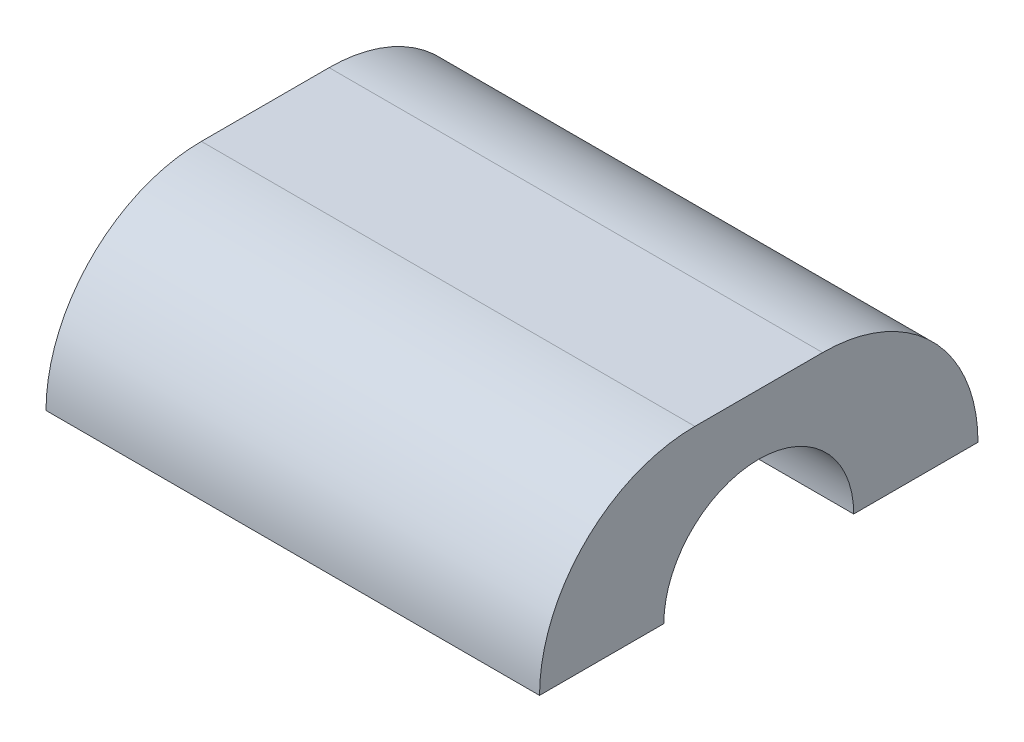
ISO-10303-21;
HEADER;
FILE_DESCRIPTION(('STEP AP214'),'2;1');
FILE_NAME('part.step','',(''),(''),'','','');
FILE_SCHEMA(('AUTOMOTIVE_DESIGN { 1 0 10303 214 1 1 1 1 }'));
ENDSEC;
DATA;
#1=APPLICATION_CONTEXT('core data for automotive mechanical design processes');
#2=APPLICATION_PROTOCOL_DEFINITION('international standard','automotive_design',2000,#1);
#3=PRODUCT_CONTEXT('',#1,'mechanical');
#4=PRODUCT('Part','Part','',(#3));
#5=PRODUCT_RELATED_PRODUCT_CATEGORY('part','',(#4));
#6=PRODUCT_DEFINITION_FORMATION('','',#4);
#7=PRODUCT_DEFINITION_CONTEXT('part definition',#1,'design');
#8=PRODUCT_DEFINITION('design','',#6,#7);
#9=PRODUCT_DEFINITION_SHAPE('','',#8);
#10=(LENGTH_UNIT() NAMED_UNIT(*) SI_UNIT(.MILLI.,.METRE.));
#11=(NAMED_UNIT(*) PLANE_ANGLE_UNIT() SI_UNIT($,.RADIAN.));
#12=(NAMED_UNIT(*) SI_UNIT($,.STERADIAN.) SOLID_ANGLE_UNIT());
#13=UNCERTAINTY_MEASURE_WITH_UNIT(LENGTH_MEASURE(1.E-05),#10,'distance_accuracy_value','');
#14=(GEOMETRIC_REPRESENTATION_CONTEXT(3) GLOBAL_UNCERTAINTY_ASSIGNED_CONTEXT((#13)) GLOBAL_UNIT_ASSIGNED_CONTEXT((#10,
#11,#12)) REPRESENTATION_CONTEXT('',''));
#15=CARTESIAN_POINT('',(0.,0.,0.));
#16=DIRECTION('',(0.,0.,1.));
#17=DIRECTION('',(1.,0.,0.));
#18=AXIS2_PLACEMENT_3D('',#15,#16,#17);
#19=CARTESIAN_POINT('',(-35.0712438022178,0.,-14.4334651993608));
#20=DIRECTION('',(-1.,0.,0.));
#21=DIRECTION('',(0.,0.,1.));
#22=AXIS2_PLACEMENT_3D('',#19,#20,#21);
#23=CYLINDRICAL_SURFACE('',#22,18.);
#24=DIRECTION('',(-1.,0.,0.));
#25=VECTOR('',#24,1.);
#26=CARTESIAN_POINT('',(-35.0712438022178,0.,-32.4334651993608));
#27=LINE('',#26,#25);
#28=CARTESIAN_POINT('',(22.1087561977822,0.,-32.4334651993608));
#29=VERTEX_POINT('',#28);
#30=CARTESIAN_POINT('',(-35.0712438022178,0.,-32.4334651993608));
#31=VERTEX_POINT('',#30);
#32=EDGE_CURVE('E120',#29,#31,#27,.T.);
#33=ORIENTED_EDGE('',*,*,#32,.T.);
#34=CARTESIAN_POINT('',(-35.0712438022178,0.,-14.4334651993608));
#35=DIRECTION('',(1.,0.,0.));
#36=DIRECTION('',(0.,0.,-1.));
#37=AXIS2_PLACEMENT_3D('',#34,#35,#36);
#38=CIRCLE('',#37,18.);
#39=CARTESIAN_POINT('',(-35.0712438022178,18.,-14.4334651993608));
#40=VERTEX_POINT('',#39);
#41=EDGE_CURVE('E47',#40,#31,#38,.F.);
#42=ORIENTED_EDGE('',*,*,#41,.F.);
#43=DIRECTION('',(1.,0.,0.));
#44=VECTOR('',#43,1.);
#45=CARTESIAN_POINT('',(-35.0712438022178,18.,-14.4334651993608));
#46=LINE('',#45,#44);
#47=CARTESIAN_POINT('',(22.1087561977822,18.,-14.4334651993608));
#48=VERTEX_POINT('',#47);
#49=EDGE_CURVE('E143',#48,#40,#46,.F.);
#50=ORIENTED_EDGE('',*,*,#49,.F.);
#51=CARTESIAN_POINT('',(22.1087561977822,0.,-14.4334651993608));
#52=DIRECTION('',(-1.,0.,0.));
#53=DIRECTION('',(0.,0.,1.));
#54=AXIS2_PLACEMENT_3D('',#51,#52,#53);
#55=CIRCLE('',#54,18.);
#56=EDGE_CURVE('E11',#29,#48,#55,.F.);
#57=ORIENTED_EDGE('',*,*,#56,.F.);
#58=EDGE_LOOP('',(#33,#42,#50,#57));
#59=FACE_BOUND('',#58,.T.);
#60=ADVANCED_FACE('F39',(#59),#23,.T.);
#61=CARTESIAN_POINT('',(-35.0712438022178,0.,0.366534800639206));
#62=DIRECTION('',(1.,0.,0.));
#63=DIRECTION('',(0.,0.,-1.));
#64=AXIS2_PLACEMENT_3D('',#61,#62,#63);
#65=CYLINDRICAL_SURFACE('',#64,18.);
#66=DIRECTION('',(1.,0.,0.));
#67=VECTOR('',#66,1.);
#68=CARTESIAN_POINT('',(-35.0712438022178,0.,18.3665348006392));
#69=LINE('',#68,#67);
#70=CARTESIAN_POINT('',(-35.0712438022178,0.,18.3665348006392));
#71=VERTEX_POINT('',#70);
#72=CARTESIAN_POINT('',(22.1087561977822,0.,18.3665348006392));
#73=VERTEX_POINT('',#72);
#74=EDGE_CURVE('E118',#71,#73,#69,.T.);
#75=ORIENTED_EDGE('',*,*,#74,.T.);
#76=CARTESIAN_POINT('',(22.1087561977822,0.,0.366534800639206));
#77=DIRECTION('',(-1.,0.,0.));
#78=DIRECTION('',(0.,0.,1.));
#79=AXIS2_PLACEMENT_3D('',#76,#77,#78);
#80=CIRCLE('',#79,18.);
#81=CARTESIAN_POINT('',(22.1087561977822,18.,0.366534800639202));
#82=VERTEX_POINT('',#81);
#83=EDGE_CURVE('E137',#82,#73,#80,.F.);
#84=ORIENTED_EDGE('',*,*,#83,.F.);
#85=DIRECTION('',(-1.,0.,0.));
#86=VECTOR('',#85,1.);
#87=CARTESIAN_POINT('',(-35.0712438022178,18.,0.366534800639206));
#88=LINE('',#87,#86);
#89=CARTESIAN_POINT('',(-35.0712438022178,18.,0.366534800639202));
#90=VERTEX_POINT('',#89);
#91=EDGE_CURVE('E133',#90,#82,#88,.F.);
#92=ORIENTED_EDGE('',*,*,#91,.F.);
#93=CARTESIAN_POINT('',(-35.0712438022178,0.,0.366534800639206));
#94=DIRECTION('',(1.,0.,0.));
#95=DIRECTION('',(0.,0.,-1.));
#96=AXIS2_PLACEMENT_3D('',#93,#94,#95);
#97=CIRCLE('',#96,18.);
#98=EDGE_CURVE('E140',#71,#90,#97,.F.);
#99=ORIENTED_EDGE('',*,*,#98,.F.);
#100=EDGE_LOOP('',(#75,#84,#92,#99));
#101=FACE_BOUND('',#100,.T.);
#102=ADVANCED_FACE('F165',(#101),#65,.T.);
#103=CARTESIAN_POINT('',(0.,0.,0.));
#104=DIRECTION('',(0.,1.,0.));
#105=DIRECTION('',(0.,0.,1.));
#106=AXIS2_PLACEMENT_3D('',#103,#104,#105);
#107=PLANE('',#106);
#108=DIRECTION('',(0.,0.,-1.));
#109=VECTOR('',#108,1.);
#110=CARTESIAN_POINT('',(22.1087561977822,0.,-32.4334651993608));
#111=LINE('',#110,#109);
#112=CARTESIAN_POINT('',(22.1087561977822,0.,-18.0334651993608));
#113=VERTEX_POINT('',#112);
#114=EDGE_CURVE('E150',#113,#29,#111,.T.);
#115=ORIENTED_EDGE('',*,*,#114,.F.);
#116=DIRECTION('',(-1.,0.,0.));
#117=VECTOR('',#116,1.);
#118=CARTESIAN_POINT('',(22.9287561977822,0.,-18.0334651993608));
#119=LINE('',#118,#117);
#120=CARTESIAN_POINT('',(-35.0712438022178,0.,-18.0334651993608));
#121=VERTEX_POINT('',#120);
#122=EDGE_CURVE('E101',#113,#121,#119,.T.);
#123=ORIENTED_EDGE('',*,*,#122,.T.);
#124=DIRECTION('',(0.,0.,1.));
#125=VECTOR('',#124,1.);
#126=CARTESIAN_POINT('',(-35.0712438022178,0.,-32.4334651993608));
#127=LINE('',#126,#125);
#128=EDGE_CURVE('E113',#31,#121,#127,.T.);
#129=ORIENTED_EDGE('',*,*,#128,.F.);
#130=ORIENTED_EDGE('',*,*,#32,.F.);
#131=EDGE_LOOP('',(#115,#123,#129,#130));
#132=FACE_BOUND('',#131,.T.);
#133=ADVANCED_FACE('F149',(#132),#107,.F.);
#134=CARTESIAN_POINT('',(22.1087561977822,18.,-32.4334651993608));
#135=DIRECTION('',(-1.,0.,0.));
#136=DIRECTION('',(0.,0.,1.));
#137=AXIS2_PLACEMENT_3D('',#134,#135,#136);
#138=PLANE('',#137);
#139=ORIENTED_EDGE('',*,*,#114,.T.);
#140=ORIENTED_EDGE('',*,*,#56,.T.);
#141=DIRECTION('',(0.,0.,-1.));
#142=VECTOR('',#141,1.);
#143=CARTESIAN_POINT('',(22.1087561977822,18.,-32.4334651993608));
#144=LINE('',#143,#142);
#145=EDGE_CURVE('E129',#82,#48,#144,.T.);
#146=ORIENTED_EDGE('',*,*,#145,.F.);
#147=ORIENTED_EDGE('',*,*,#83,.T.);
#148=CARTESIAN_POINT('',(22.1087561977822,0.,3.9665348006392));
#149=VERTEX_POINT('',#148);
#150=EDGE_CURVE('E124',#73,#149,#111,.T.);
#151=ORIENTED_EDGE('',*,*,#150,.T.);
#152=CARTESIAN_POINT('',(22.1087561977822,0.,-7.0334651993608));
#153=DIRECTION('',(-1.,0.,0.));
#154=DIRECTION('',(0.,0.,1.));
#155=AXIS2_PLACEMENT_3D('',#152,#153,#154);
#156=CIRCLE('',#155,11.);
#157=EDGE_CURVE('E95',#149,#113,#156,.T.);
#158=ORIENTED_EDGE('',*,*,#157,.T.);
#159=EDGE_LOOP('',(#139,#140,#146,#147,#151,#158));
#160=FACE_BOUND('',#159,.T.);
#161=ADVANCED_FACE('F151',(#160),#138,.F.);
#162=CARTESIAN_POINT('',(-35.0712438022178,18.,-32.4334651993608));
#163=DIRECTION('',(1.,0.,0.));
#164=DIRECTION('',(0.,0.,-1.));
#165=AXIS2_PLACEMENT_3D('',#162,#163,#164);
#166=PLANE('',#165);
#167=DIRECTION('',(0.,0.,1.));
#168=VECTOR('',#167,1.);
#169=CARTESIAN_POINT('',(-35.0712438022178,18.,-32.4334651993608));
#170=LINE('',#169,#168);
#171=EDGE_CURVE('E102',#40,#90,#170,.T.);
#172=ORIENTED_EDGE('',*,*,#171,.F.);
#173=ORIENTED_EDGE('',*,*,#41,.T.);
#174=ORIENTED_EDGE('',*,*,#128,.T.);
#175=CARTESIAN_POINT('',(-35.0712438022178,0.,-7.0334651993608));
#176=DIRECTION('',(-1.,0.,0.));
#177=DIRECTION('',(0.,0.,1.));
#178=AXIS2_PLACEMENT_3D('',#175,#176,#177);
#179=CIRCLE('',#178,11.);
#180=CARTESIAN_POINT('',(-35.0712438022178,0.,3.9665348006392));
#181=VERTEX_POINT('',#180);
#182=EDGE_CURVE('E92',#181,#121,#179,.T.);
#183=ORIENTED_EDGE('',*,*,#182,.F.);
#184=EDGE_CURVE('E110',#181,#71,#127,.T.);
#185=ORIENTED_EDGE('',*,*,#184,.T.);
#186=ORIENTED_EDGE('',*,*,#98,.T.);
#187=EDGE_LOOP('',(#172,#173,#174,#183,#185,#186));
#188=FACE_BOUND('',#187,.T.);
#189=ADVANCED_FACE('F108',(#188),#166,.F.);
#190=CARTESIAN_POINT('',(0.,18.,0.));
#191=DIRECTION('',(0.,1.,0.));
#192=DIRECTION('',(0.,0.,1.));
#193=AXIS2_PLACEMENT_3D('',#190,#191,#192);
#194=PLANE('',#193);
#195=ORIENTED_EDGE('',*,*,#145,.T.);
#196=ORIENTED_EDGE('',*,*,#49,.T.);
#197=ORIENTED_EDGE('',*,*,#171,.T.);
#198=ORIENTED_EDGE('',*,*,#91,.T.);
#199=EDGE_LOOP('',(#195,#196,#197,#198));
#200=FACE_BOUND('',#199,.T.);
#201=ADVANCED_FACE('F162',(#200),#194,.T.);
#202=ORIENTED_EDGE('',*,*,#184,.F.);
#203=DIRECTION('',(-1.,0.,0.));
#204=VECTOR('',#203,1.);
#205=CARTESIAN_POINT('',(22.9287561977822,0.,3.9665348006392));
#206=LINE('',#205,#204);
#207=EDGE_CURVE('E89',#181,#149,#206,.F.);
#208=ORIENTED_EDGE('',*,*,#207,.T.);
#209=ORIENTED_EDGE('',*,*,#150,.F.);
#210=ORIENTED_EDGE('',*,*,#74,.F.);
#211=EDGE_LOOP('',(#202,#208,#209,#210));
#212=FACE_BOUND('',#211,.T.);
#213=ADVANCED_FACE('F116',(#212),#107,.F.);
#214=CARTESIAN_POINT('',(22.9287561977822,0.,-7.0334651993608));
#215=DIRECTION('',(-1.,0.,0.));
#216=DIRECTION('',(0.,0.,1.));
#217=AXIS2_PLACEMENT_3D('',#214,#215,#216);
#218=CYLINDRICAL_SURFACE('',#217,11.);
#219=ORIENTED_EDGE('',*,*,#157,.F.);
#220=ORIENTED_EDGE('',*,*,#207,.F.);
#221=ORIENTED_EDGE('',*,*,#182,.T.);
#222=ORIENTED_EDGE('',*,*,#122,.F.);
#223=EDGE_LOOP('',(#219,#220,#221,#222));
#224=FACE_BOUND('',#223,.T.);
#225=ADVANCED_FACE('F91',(#224),#218,.F.);
#226=CLOSED_SHELL('',(#60,#102,#133,#161,#189,#201,#213,#225));
#227=MANIFOLD_SOLID_BREP('B2',#226);
#228=ADVANCED_BREP_SHAPE_REPRESENTATION('',(#18,#227),#14);
#229=SHAPE_DEFINITION_REPRESENTATION(#9,#228);
ENDSEC;
END-ISO-10303-21;
